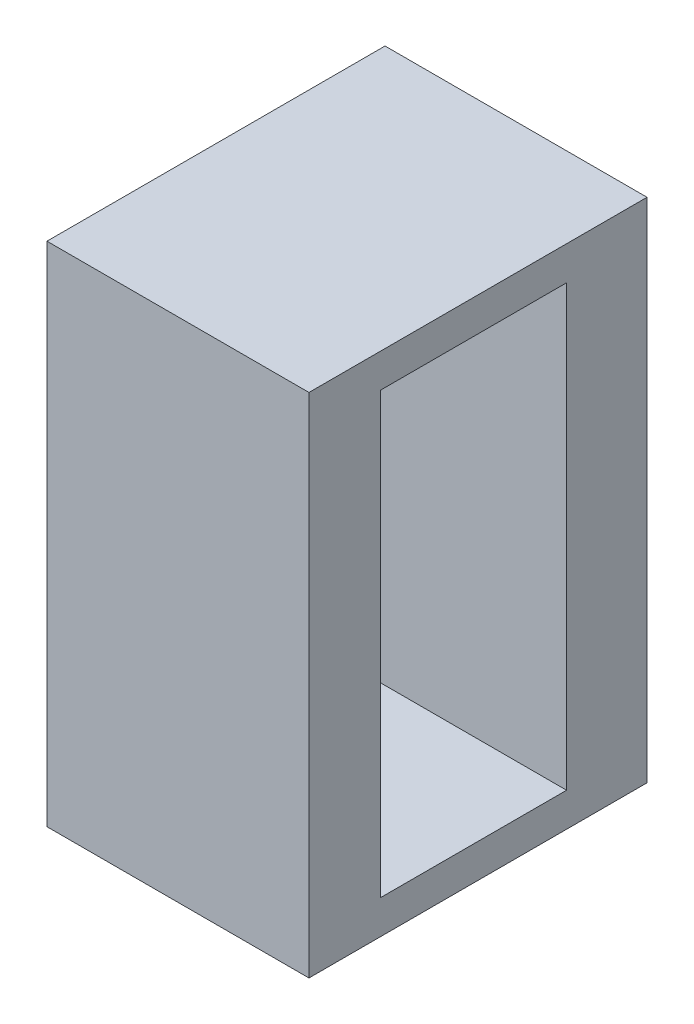
ISO-10303-21;
HEADER;
FILE_DESCRIPTION(('STEP AP214'),'2;1');
FILE_NAME('part.step','',(''),(''),'','','');
FILE_SCHEMA(('AUTOMOTIVE_DESIGN { 1 0 10303 214 1 1 1 1 }'));
ENDSEC;
DATA;
#1=APPLICATION_CONTEXT('core data for automotive mechanical design processes');
#2=APPLICATION_PROTOCOL_DEFINITION('international standard','automotive_design',2000,#1);
#3=PRODUCT_CONTEXT('',#1,'mechanical');
#4=PRODUCT('Part','Part','',(#3));
#5=PRODUCT_RELATED_PRODUCT_CATEGORY('part','',(#4));
#6=PRODUCT_DEFINITION_FORMATION('','',#4);
#7=PRODUCT_DEFINITION_CONTEXT('part definition',#1,'design');
#8=PRODUCT_DEFINITION('design','',#6,#7);
#9=PRODUCT_DEFINITION_SHAPE('','',#8);
#10=(LENGTH_UNIT() NAMED_UNIT(*) SI_UNIT(.MILLI.,.METRE.));
#11=(NAMED_UNIT(*) PLANE_ANGLE_UNIT() SI_UNIT($,.RADIAN.));
#12=(NAMED_UNIT(*) SI_UNIT($,.STERADIAN.) SOLID_ANGLE_UNIT());
#13=UNCERTAINTY_MEASURE_WITH_UNIT(LENGTH_MEASURE(1.E-05),#10,'distance_accuracy_value','');
#14=(GEOMETRIC_REPRESENTATION_CONTEXT(3) GLOBAL_UNCERTAINTY_ASSIGNED_CONTEXT((#13)) GLOBAL_UNIT_ASSIGNED_CONTEXT((#10,
#11,#12)) REPRESENTATION_CONTEXT('',''));
#15=CARTESIAN_POINT('',(0.,0.,0.));
#16=DIRECTION('',(0.,0.,1.));
#17=DIRECTION('',(1.,0.,0.));
#18=AXIS2_PLACEMENT_3D('',#15,#16,#17);
#19=CARTESIAN_POINT('',(-3.88034999999824,20.88337,4.));
#20=DIRECTION('',(0.,1.,0.));
#21=DIRECTION('',(0.,0.,1.));
#22=AXIS2_PLACEMENT_3D('',#19,#20,#21);
#23=PLANE('',#22);
#24=DIRECTION('',(1.,0.,0.));
#25=VECTOR('',#24,1.);
#26=CARTESIAN_POINT('',(-3.88034999999824,20.88337,0.));
#27=LINE('',#26,#25);
#28=CARTESIAN_POINT('',(-3.88034999999824,20.88337,0.));
#29=VERTEX_POINT('',#28);
#30=CARTESIAN_POINT('',(-0.780349999999392,20.88337,0.));
#31=VERTEX_POINT('',#30);
#32=EDGE_CURVE('E147',#29,#31,#27,.T.);
#33=ORIENTED_EDGE('',*,*,#32,.F.);
#34=DIRECTION('',(0.,0.,-1.));
#35=VECTOR('',#34,1.);
#36=CARTESIAN_POINT('',(-3.88034999999824,20.88337,4.));
#37=LINE('',#36,#35);
#38=CARTESIAN_POINT('',(-3.88034999999824,20.88337,4.));
#39=VERTEX_POINT('',#38);
#40=EDGE_CURVE('E11',#39,#29,#37,.T.);
#41=ORIENTED_EDGE('',*,*,#40,.F.);
#42=DIRECTION('',(1.,0.,0.));
#43=VECTOR('',#42,1.);
#44=CARTESIAN_POINT('',(-3.88034999999824,20.88337,4.));
#45=LINE('',#44,#43);
#46=CARTESIAN_POINT('',(-0.780349999999392,20.88337,4.));
#47=VERTEX_POINT('',#46);
#48=EDGE_CURVE('E151',#39,#47,#45,.T.);
#49=ORIENTED_EDGE('',*,*,#48,.T.);
#50=DIRECTION('',(0.,0.,-1.));
#51=VECTOR('',#50,1.);
#52=CARTESIAN_POINT('',(-0.780349999999392,20.88337,4.));
#53=LINE('',#52,#51);
#54=EDGE_CURVE('E44',#47,#31,#53,.T.);
#55=ORIENTED_EDGE('',*,*,#54,.T.);
#56=EDGE_LOOP('',(#33,#41,#49,#55));
#57=FACE_BOUND('',#56,.T.);
#58=ADVANCED_FACE('F41',(#57),#23,.T.);
#59=CARTESIAN_POINT('',(-3.88034999999824,20.88337,4.));
#60=DIRECTION('',(1.,0.,0.));
#61=DIRECTION('',(0.,0.,-1.));
#62=AXIS2_PLACEMENT_3D('',#59,#60,#61);
#63=PLANE('',#62);
#64=DIRECTION('',(0.,-1.,0.));
#65=VECTOR('',#64,1.);
#66=CARTESIAN_POINT('',(-3.88034999999824,20.88337,0.));
#67=LINE('',#66,#65);
#68=CARTESIAN_POINT('',(-3.88034999999824,14.88337,0.));
#69=VERTEX_POINT('',#68);
#70=EDGE_CURVE('E154',#29,#69,#67,.T.);
#71=ORIENTED_EDGE('',*,*,#70,.T.);
#72=DIRECTION('',(0.,0.,-1.));
#73=VECTOR('',#72,1.);
#74=CARTESIAN_POINT('',(-3.88034999999824,14.88337,4.));
#75=LINE('',#74,#73);
#76=CARTESIAN_POINT('',(-3.88034999999824,14.88337,4.));
#77=VERTEX_POINT('',#76);
#78=EDGE_CURVE('E49',#77,#69,#75,.T.);
#79=ORIENTED_EDGE('',*,*,#78,.F.);
#80=DIRECTION('',(0.,-1.,0.));
#81=VECTOR('',#80,1.);
#82=CARTESIAN_POINT('',(-3.88034999999824,20.88337,4.));
#83=LINE('',#82,#81);
#84=EDGE_CURVE('E158',#39,#77,#83,.T.);
#85=ORIENTED_EDGE('',*,*,#84,.F.);
#86=ORIENTED_EDGE('',*,*,#40,.T.);
#87=EDGE_LOOP('',(#71,#79,#85,#86));
#88=FACE_BOUND('',#87,.T.);
#89=ADVANCED_FACE('F178',(#88),#63,.F.);
#90=CARTESIAN_POINT('',(-3.88034999999824,14.88337,4.));
#91=DIRECTION('',(0.,1.,0.));
#92=DIRECTION('',(0.,0.,1.));
#93=AXIS2_PLACEMENT_3D('',#90,#91,#92);
#94=PLANE('',#93);
#95=DIRECTION('',(1.,0.,0.));
#96=VECTOR('',#95,1.);
#97=CARTESIAN_POINT('',(-3.88034999999824,14.88337,0.));
#98=LINE('',#97,#96);
#99=CARTESIAN_POINT('',(-0.780349999999392,14.88337,0.));
#100=VERTEX_POINT('',#99);
#101=EDGE_CURVE('E165',#69,#100,#98,.T.);
#102=ORIENTED_EDGE('',*,*,#101,.T.);
#103=DIRECTION('',(0.,0.,-1.));
#104=VECTOR('',#103,1.);
#105=CARTESIAN_POINT('',(-0.780349999999392,14.88337,4.));
#106=LINE('',#105,#104);
#107=CARTESIAN_POINT('',(-0.780349999999392,14.88337,4.));
#108=VERTEX_POINT('',#107);
#109=EDGE_CURVE('E170',#108,#100,#106,.T.);
#110=ORIENTED_EDGE('',*,*,#109,.F.);
#111=DIRECTION('',(1.,0.,0.));
#112=VECTOR('',#111,1.);
#113=CARTESIAN_POINT('',(-3.88034999999824,14.88337,4.));
#114=LINE('',#113,#112);
#115=EDGE_CURVE('E156',#77,#108,#114,.T.);
#116=ORIENTED_EDGE('',*,*,#115,.F.);
#117=ORIENTED_EDGE('',*,*,#78,.T.);
#118=EDGE_LOOP('',(#102,#110,#116,#117));
#119=FACE_BOUND('',#118,.T.);
#120=ADVANCED_FACE('F181',(#119),#94,.F.);
#121=CARTESIAN_POINT('',(-0.780349999999392,20.88337,4.));
#122=DIRECTION('',(1.,0.,0.));
#123=DIRECTION('',(0.,0.,-1.));
#124=AXIS2_PLACEMENT_3D('',#121,#122,#123);
#125=PLANE('',#124);
#126=DIRECTION('',(0.,-1.,0.));
#127=VECTOR('',#126,1.);
#128=CARTESIAN_POINT('',(-0.780349999999392,20.48337,3.15201787750041));
#129=LINE('',#128,#127);
#130=CARTESIAN_POINT('',(-0.780349999999392,20.48337,3.15201787750041));
#131=VERTEX_POINT('',#130);
#132=CARTESIAN_POINT('',(-0.780349999999392,15.28337,3.15201787750041));
#133=VERTEX_POINT('',#132);
#134=EDGE_CURVE('E57',#131,#133,#129,.T.);
#135=ORIENTED_EDGE('',*,*,#134,.F.);
#136=DIRECTION('',(0.,0.,1.));
#137=VECTOR('',#136,1.);
#138=CARTESIAN_POINT('',(-0.780349999999392,20.48337,3.15201787750041));
#139=LINE('',#138,#137);
#140=CARTESIAN_POINT('',(-0.780349999999392,20.48337,0.952017877500412));
#141=VERTEX_POINT('',#140);
#142=EDGE_CURVE('E132',#141,#131,#139,.T.);
#143=ORIENTED_EDGE('',*,*,#142,.F.);
#144=DIRECTION('',(0.,1.,0.));
#145=VECTOR('',#144,1.);
#146=CARTESIAN_POINT('',(-0.780349999999392,20.48337,0.952017877500412));
#147=LINE('',#146,#145);
#148=CARTESIAN_POINT('',(-0.780349999999392,15.28337,0.952017877500412));
#149=VERTEX_POINT('',#148);
#150=EDGE_CURVE('E135',#149,#141,#147,.T.);
#151=ORIENTED_EDGE('',*,*,#150,.F.);
#152=DIRECTION('',(0.,0.,-1.));
#153=VECTOR('',#152,1.);
#154=CARTESIAN_POINT('',(-0.780349999999392,15.28337,3.15201787750041));
#155=LINE('',#154,#153);
#156=EDGE_CURVE('E141',#133,#149,#155,.T.);
#157=ORIENTED_EDGE('',*,*,#156,.F.);
#158=EDGE_LOOP('',(#135,#143,#151,#157));
#159=FACE_BOUND('',#158,.T.);
#160=DIRECTION('',(0.,-1.,0.));
#161=VECTOR('',#160,1.);
#162=CARTESIAN_POINT('',(-0.780349999999392,20.88337,0.));
#163=LINE('',#162,#161);
#164=EDGE_CURVE('E162',#31,#100,#163,.T.);
#165=ORIENTED_EDGE('',*,*,#164,.F.);
#166=ORIENTED_EDGE('',*,*,#54,.F.);
#167=DIRECTION('',(0.,-1.,0.));
#168=VECTOR('',#167,1.);
#169=CARTESIAN_POINT('',(-0.780349999999392,20.88337,4.));
#170=LINE('',#169,#168);
#171=EDGE_CURVE('E153',#47,#108,#170,.T.);
#172=ORIENTED_EDGE('',*,*,#171,.T.);
#173=ORIENTED_EDGE('',*,*,#109,.T.);
#174=EDGE_LOOP('',(#165,#166,#172,#173));
#175=FACE_BOUND('',#174,.T.);
#176=ADVANCED_FACE('F173',(#159,#175),#125,.T.);
#177=CARTESIAN_POINT('',(0.,0.,4.));
#178=DIRECTION('',(0.,0.,-1.));
#179=DIRECTION('',(-1.,0.,0.));
#180=AXIS2_PLACEMENT_3D('',#177,#178,#179);
#181=PLANE('',#180);
#182=ORIENTED_EDGE('',*,*,#48,.F.);
#183=ORIENTED_EDGE('',*,*,#84,.T.);
#184=ORIENTED_EDGE('',*,*,#115,.T.);
#185=ORIENTED_EDGE('',*,*,#171,.F.);
#186=EDGE_LOOP('',(#182,#183,#184,#185));
#187=FACE_BOUND('',#186,.T.);
#188=ADVANCED_FACE('F183',(#187),#181,.F.);
#189=CARTESIAN_POINT('',(0.,0.,0.));
#190=DIRECTION('',(0.,0.,-1.));
#191=DIRECTION('',(-1.,0.,0.));
#192=AXIS2_PLACEMENT_3D('',#189,#190,#191);
#193=PLANE('',#192);
#194=ORIENTED_EDGE('',*,*,#32,.T.);
#195=ORIENTED_EDGE('',*,*,#164,.T.);
#196=ORIENTED_EDGE('',*,*,#101,.F.);
#197=ORIENTED_EDGE('',*,*,#70,.F.);
#198=EDGE_LOOP('',(#194,#195,#196,#197));
#199=FACE_BOUND('',#198,.T.);
#200=ADVANCED_FACE('F176',(#199),#193,.T.);
#201=CARTESIAN_POINT('',(-3.48034999999939,20.48337,3.15201787750041));
#202=DIRECTION('',(0.,0.,1.));
#203=DIRECTION('',(1.,0.,0.));
#204=AXIS2_PLACEMENT_3D('',#201,#202,#203);
#205=PLANE('',#204);
#206=ORIENTED_EDGE('',*,*,#134,.T.);
#207=DIRECTION('',(1.,0.,0.));
#208=VECTOR('',#207,1.);
#209=CARTESIAN_POINT('',(-3.48034999999939,15.28337,3.15201787750041));
#210=LINE('',#209,#208);
#211=CARTESIAN_POINT('',(-3.48034999999939,15.28337,3.15201787750041));
#212=VERTEX_POINT('',#211);
#213=EDGE_CURVE('E110',#212,#133,#210,.T.);
#214=ORIENTED_EDGE('',*,*,#213,.F.);
#215=DIRECTION('',(0.,-1.,0.));
#216=VECTOR('',#215,1.);
#217=CARTESIAN_POINT('',(-3.48034999999939,20.48337,3.15201787750041));
#218=LINE('',#217,#216);
#219=CARTESIAN_POINT('',(-3.48034999999939,20.48337,3.15201787750041));
#220=VERTEX_POINT('',#219);
#221=EDGE_CURVE('E114',#220,#212,#218,.T.);
#222=ORIENTED_EDGE('',*,*,#221,.F.);
#223=DIRECTION('',(1.,0.,0.));
#224=VECTOR('',#223,1.);
#225=CARTESIAN_POINT('',(-3.48034999999939,20.48337,3.15201787750041));
#226=LINE('',#225,#224);
#227=EDGE_CURVE('E145',#220,#131,#226,.T.);
#228=ORIENTED_EDGE('',*,*,#227,.T.);
#229=EDGE_LOOP('',(#206,#214,#222,#228));
#230=FACE_BOUND('',#229,.T.);
#231=ADVANCED_FACE('F112',(#230),#205,.F.);
#232=CARTESIAN_POINT('',(-3.48034999999939,20.48337,3.15201787750041));
#233=DIRECTION('',(0.,1.,0.));
#234=DIRECTION('',(0.,0.,1.));
#235=AXIS2_PLACEMENT_3D('',#232,#233,#234);
#236=PLANE('',#235);
#237=ORIENTED_EDGE('',*,*,#142,.T.);
#238=ORIENTED_EDGE('',*,*,#227,.F.);
#239=DIRECTION('',(0.,0.,1.));
#240=VECTOR('',#239,1.);
#241=CARTESIAN_POINT('',(-3.48034999999939,20.48337,3.15201787750041));
#242=LINE('',#241,#240);
#243=CARTESIAN_POINT('',(-3.48034999999939,20.48337,0.952017877500412));
#244=VERTEX_POINT('',#243);
#245=EDGE_CURVE('E120',#244,#220,#242,.T.);
#246=ORIENTED_EDGE('',*,*,#245,.F.);
#247=DIRECTION('',(1.,0.,0.));
#248=VECTOR('',#247,1.);
#249=CARTESIAN_POINT('',(-3.48034999999939,20.48337,0.952017877500412));
#250=LINE('',#249,#248);
#251=EDGE_CURVE('E148',#244,#141,#250,.T.);
#252=ORIENTED_EDGE('',*,*,#251,.T.);
#253=EDGE_LOOP('',(#237,#238,#246,#252));
#254=FACE_BOUND('',#253,.T.);
#255=ADVANCED_FACE('F222',(#254),#236,.F.);
#256=CARTESIAN_POINT('',(-3.48034999999939,20.48337,0.952017877500412));
#257=DIRECTION('',(0.,0.,-1.));
#258=DIRECTION('',(-1.,0.,0.));
#259=AXIS2_PLACEMENT_3D('',#256,#257,#258);
#260=PLANE('',#259);
#261=ORIENTED_EDGE('',*,*,#150,.T.);
#262=ORIENTED_EDGE('',*,*,#251,.F.);
#263=DIRECTION('',(0.,1.,0.));
#264=VECTOR('',#263,1.);
#265=CARTESIAN_POINT('',(-3.48034999999939,20.48337,0.952017877500412));
#266=LINE('',#265,#264);
#267=CARTESIAN_POINT('',(-3.48034999999939,15.28337,0.952017877500412));
#268=VERTEX_POINT('',#267);
#269=EDGE_CURVE('E128',#268,#244,#266,.T.);
#270=ORIENTED_EDGE('',*,*,#269,.F.);
#271=DIRECTION('',(1.,0.,0.));
#272=VECTOR('',#271,1.);
#273=CARTESIAN_POINT('',(-3.48034999999939,15.28337,0.952017877500412));
#274=LINE('',#273,#272);
#275=EDGE_CURVE('E119',#268,#149,#274,.T.);
#276=ORIENTED_EDGE('',*,*,#275,.T.);
#277=EDGE_LOOP('',(#261,#262,#270,#276));
#278=FACE_BOUND('',#277,.T.);
#279=ADVANCED_FACE('F231',(#278),#260,.F.);
#280=CARTESIAN_POINT('',(-3.48034999999939,15.28337,3.15201787750041));
#281=DIRECTION('',(0.,-1.,0.));
#282=DIRECTION('',(0.,0.,-1.));
#283=AXIS2_PLACEMENT_3D('',#280,#281,#282);
#284=PLANE('',#283);
#285=ORIENTED_EDGE('',*,*,#156,.T.);
#286=ORIENTED_EDGE('',*,*,#275,.F.);
#287=DIRECTION('',(0.,0.,-1.));
#288=VECTOR('',#287,1.);
#289=CARTESIAN_POINT('',(-3.48034999999939,15.28337,3.15201787750041));
#290=LINE('',#289,#288);
#291=EDGE_CURVE('E123',#212,#268,#290,.T.);
#292=ORIENTED_EDGE('',*,*,#291,.F.);
#293=ORIENTED_EDGE('',*,*,#213,.T.);
#294=EDGE_LOOP('',(#285,#286,#292,#293));
#295=FACE_BOUND('',#294,.T.);
#296=ADVANCED_FACE('F124',(#295),#284,.F.);
#297=CARTESIAN_POINT('',(-3.48034999999939,0.,0.));
#298=DIRECTION('',(1.,0.,0.));
#299=DIRECTION('',(0.,0.,-1.));
#300=AXIS2_PLACEMENT_3D('',#297,#298,#299);
#301=PLANE('',#300);
#302=ORIENTED_EDGE('',*,*,#221,.T.);
#303=ORIENTED_EDGE('',*,*,#291,.T.);
#304=ORIENTED_EDGE('',*,*,#269,.T.);
#305=ORIENTED_EDGE('',*,*,#245,.T.);
#306=EDGE_LOOP('',(#302,#303,#304,#305));
#307=FACE_BOUND('',#306,.T.);
#308=ADVANCED_FACE('F130',(#307),#301,.T.);
#309=CLOSED_SHELL('',(#58,#89,#120,#176,#188,#200,#231,#255,#279,#296,#308));
#310=MANIFOLD_SOLID_BREP('B2',#309);
#311=ADVANCED_BREP_SHAPE_REPRESENTATION('',(#18,#310),#14);
#312=SHAPE_DEFINITION_REPRESENTATION(#9,#311);
ENDSEC;
END-ISO-10303-21;
